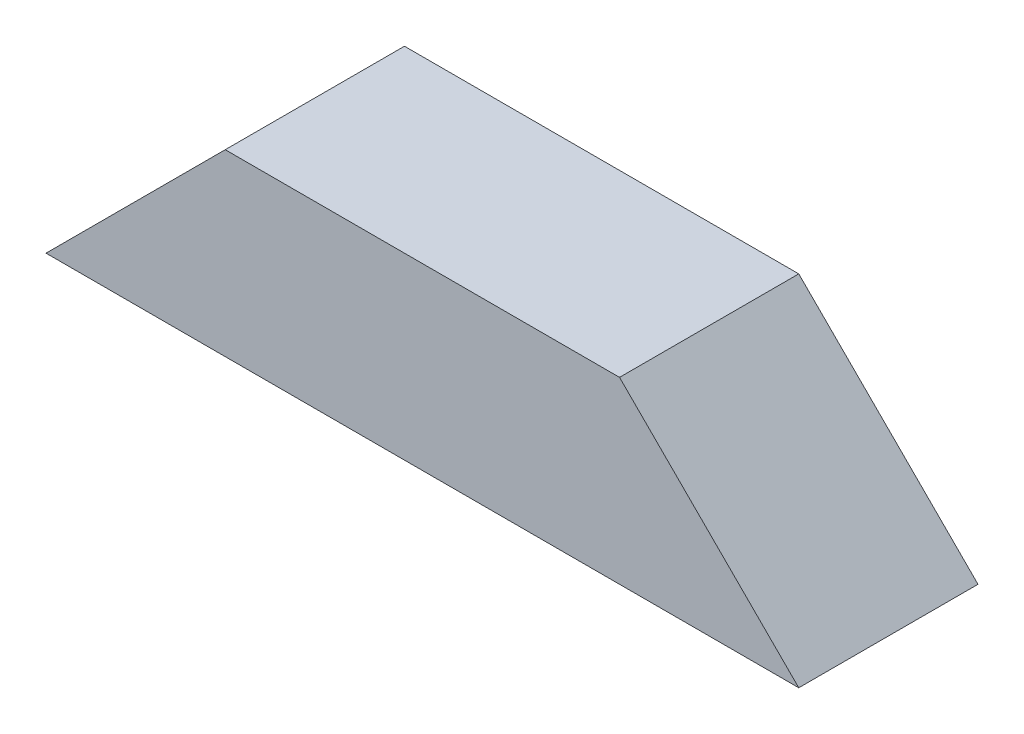
ISO-10303-21;
HEADER;
FILE_DESCRIPTION(('STEP AP214'),'2;1');
FILE_NAME('part.step','',(''),(''),'','','');
FILE_SCHEMA(('AUTOMOTIVE_DESIGN { 1 0 10303 214 1 1 1 1 }'));
ENDSEC;
DATA;
#1=APPLICATION_CONTEXT('core data for automotive mechanical design processes');
#2=APPLICATION_PROTOCOL_DEFINITION('international standard','automotive_design',2000,#1);
#3=PRODUCT_CONTEXT('',#1,'mechanical');
#4=PRODUCT('Part','Part','',(#3));
#5=PRODUCT_RELATED_PRODUCT_CATEGORY('part','',(#4));
#6=PRODUCT_DEFINITION_FORMATION('','',#4);
#7=PRODUCT_DEFINITION_CONTEXT('part definition',#1,'design');
#8=PRODUCT_DEFINITION('design','',#6,#7);
#9=PRODUCT_DEFINITION_SHAPE('','',#8);
#10=(LENGTH_UNIT() NAMED_UNIT(*) SI_UNIT(.MILLI.,.METRE.));
#11=(NAMED_UNIT(*) PLANE_ANGLE_UNIT() SI_UNIT($,.RADIAN.));
#12=(NAMED_UNIT(*) SI_UNIT($,.STERADIAN.) SOLID_ANGLE_UNIT());
#13=UNCERTAINTY_MEASURE_WITH_UNIT(LENGTH_MEASURE(1.E-05),#10,'distance_accuracy_value','');
#14=(GEOMETRIC_REPRESENTATION_CONTEXT(3) GLOBAL_UNCERTAINTY_ASSIGNED_CONTEXT((#13)) GLOBAL_UNIT_ASSIGNED_CONTEXT((#10,
#11,#12)) REPRESENTATION_CONTEXT('',''));
#15=CARTESIAN_POINT('',(0.,0.,0.));
#16=DIRECTION('',(0.,0.,1.));
#17=DIRECTION('',(1.,0.,0.));
#18=AXIS2_PLACEMENT_3D('',#15,#16,#17);
#19=CARTESIAN_POINT('',(77.2870340035174,99.844207637669,20.));
#20=DIRECTION('',(0.707106781186548,-0.707106781186548,0.));
#21=DIRECTION('',(0.707106781186548,0.707106781186548,0.));
#22=AXIS2_PLACEMENT_3D('',#19,#20,#21);
#23=PLANE('',#22);
#24=DIRECTION('',(-0.707106781186548,-0.707106781186548,0.));
#25=VECTOR('',#24,1.);
#26=CARTESIAN_POINT('',(77.2870340035174,99.844207637669,0.));
#27=LINE('',#26,#25);
#28=CARTESIAN_POINT('',(97.2870340035174,119.844207637669,0.));
#29=VERTEX_POINT('',#28);
#30=CARTESIAN_POINT('',(77.2870340035174,99.844207637669,0.));
#31=VERTEX_POINT('',#30);
#32=EDGE_CURVE('E109',#29,#31,#27,.T.);
#33=ORIENTED_EDGE('',*,*,#32,.T.);
#34=DIRECTION('',(0.,0.,-1.));
#35=VECTOR('',#34,1.);
#36=CARTESIAN_POINT('',(77.2870340035174,99.844207637669,20.));
#37=LINE('',#36,#35);
#38=CARTESIAN_POINT('',(77.2870340035174,99.844207637669,20.));
#39=VERTEX_POINT('',#38);
#40=EDGE_CURVE('E11',#39,#31,#37,.T.);
#41=ORIENTED_EDGE('',*,*,#40,.F.);
#42=DIRECTION('',(-0.707106781186548,-0.707106781186548,0.));
#43=VECTOR('',#42,1.);
#44=CARTESIAN_POINT('',(77.2870340035174,99.844207637669,20.));
#45=LINE('',#44,#43);
#46=CARTESIAN_POINT('',(97.2870340035174,119.844207637669,20.));
#47=VERTEX_POINT('',#46);
#48=EDGE_CURVE('E91',#47,#39,#45,.T.);
#49=ORIENTED_EDGE('',*,*,#48,.F.);
#50=DIRECTION('',(0.,0.,-1.));
#51=VECTOR('',#50,1.);
#52=CARTESIAN_POINT('',(97.2870340035174,119.844207637669,20.));
#53=LINE('',#52,#51);
#54=EDGE_CURVE('E105',#47,#29,#53,.T.);
#55=ORIENTED_EDGE('',*,*,#54,.T.);
#56=EDGE_LOOP('',(#33,#41,#49,#55));
#57=FACE_BOUND('',#56,.T.);
#58=ADVANCED_FACE('F39',(#57),#23,.F.);
#59=CARTESIAN_POINT('',(77.2870340035174,99.844207637669,20.));
#60=DIRECTION('',(0.,1.,0.));
#61=DIRECTION('',(-1.,0.,0.));
#62=AXIS2_PLACEMENT_3D('',#59,#60,#61);
#63=PLANE('',#62);
#64=DIRECTION('',(1.,0.,0.));
#65=VECTOR('',#64,1.);
#66=CARTESIAN_POINT('',(77.2870340035174,99.844207637669,0.));
#67=LINE('',#66,#65);
#68=CARTESIAN_POINT('',(161.287067603518,99.8442076376689,0.));
#69=VERTEX_POINT('',#68);
#70=EDGE_CURVE('E96',#31,#69,#67,.T.);
#71=ORIENTED_EDGE('',*,*,#70,.T.);
#72=DIRECTION('',(0.,0.,-1.));
#73=VECTOR('',#72,1.);
#74=CARTESIAN_POINT('',(161.287067603518,99.8442076376689,20.));
#75=LINE('',#74,#73);
#76=CARTESIAN_POINT('',(161.287067603518,99.8442076376689,20.));
#77=VERTEX_POINT('',#76);
#78=EDGE_CURVE('E48',#77,#69,#75,.T.);
#79=ORIENTED_EDGE('',*,*,#78,.F.);
#80=DIRECTION('',(1.,0.,0.));
#81=VECTOR('',#80,1.);
#82=CARTESIAN_POINT('',(77.2870340035174,99.844207637669,20.));
#83=LINE('',#82,#81);
#84=EDGE_CURVE('E86',#39,#77,#83,.T.);
#85=ORIENTED_EDGE('',*,*,#84,.F.);
#86=ORIENTED_EDGE('',*,*,#40,.T.);
#87=EDGE_LOOP('',(#71,#79,#85,#86));
#88=FACE_BOUND('',#87,.T.);
#89=ADVANCED_FACE('F95',(#88),#63,.F.);
#90=CARTESIAN_POINT('',(161.287067603518,99.8442076376689,20.));
#91=DIRECTION('',(-0.707106781186541,-0.707106781186554,0.));
#92=DIRECTION('',(0.707106781186554,-0.707106781186541,0.));
#93=AXIS2_PLACEMENT_3D('',#90,#91,#92);
#94=PLANE('',#93);
#95=DIRECTION('',(-0.707106781186554,0.707106781186541,0.));
#96=VECTOR('',#95,1.);
#97=CARTESIAN_POINT('',(161.287067603518,99.8442076376689,0.));
#98=LINE('',#97,#96);
#99=CARTESIAN_POINT('',(141.287067603517,119.844207637669,0.));
#100=VERTEX_POINT('',#99);
#101=EDGE_CURVE('E73',#69,#100,#98,.T.);
#102=ORIENTED_EDGE('',*,*,#101,.T.);
#103=DIRECTION('',(0.,0.,-1.));
#104=VECTOR('',#103,1.);
#105=CARTESIAN_POINT('',(141.287067603517,119.844207637669,20.));
#106=LINE('',#105,#104);
#107=CARTESIAN_POINT('',(141.287067603517,119.844207637669,20.));
#108=VERTEX_POINT('',#107);
#109=EDGE_CURVE('E98',#108,#100,#106,.T.);
#110=ORIENTED_EDGE('',*,*,#109,.F.);
#111=DIRECTION('',(-0.707106781186554,0.707106781186541,0.));
#112=VECTOR('',#111,1.);
#113=CARTESIAN_POINT('',(161.287067603518,99.8442076376689,20.));
#114=LINE('',#113,#112);
#115=EDGE_CURVE('E89',#77,#108,#114,.T.);
#116=ORIENTED_EDGE('',*,*,#115,.F.);
#117=ORIENTED_EDGE('',*,*,#78,.T.);
#118=EDGE_LOOP('',(#102,#110,#116,#117));
#119=FACE_BOUND('',#118,.T.);
#120=ADVANCED_FACE('F99',(#119),#94,.F.);
#121=CARTESIAN_POINT('',(97.2870340035174,119.844207637669,20.));
#122=DIRECTION('',(0.,-1.,0.));
#123=DIRECTION('',(0.,0.,-1.));
#124=AXIS2_PLACEMENT_3D('',#121,#122,#123);
#125=PLANE('',#124);
#126=DIRECTION('',(-1.,0.,0.));
#127=VECTOR('',#126,1.);
#128=CARTESIAN_POINT('',(97.2870340035174,119.844207637669,0.));
#129=LINE('',#128,#127);
#130=EDGE_CURVE('E79',#100,#29,#129,.T.);
#131=ORIENTED_EDGE('',*,*,#130,.T.);
#132=ORIENTED_EDGE('',*,*,#54,.F.);
#133=DIRECTION('',(-1.,0.,0.));
#134=VECTOR('',#133,1.);
#135=CARTESIAN_POINT('',(97.2870340035174,119.844207637669,20.));
#136=LINE('',#135,#134);
#137=EDGE_CURVE('E56',#108,#47,#136,.T.);
#138=ORIENTED_EDGE('',*,*,#137,.F.);
#139=ORIENTED_EDGE('',*,*,#109,.T.);
#140=EDGE_LOOP('',(#131,#132,#138,#139));
#141=FACE_BOUND('',#140,.T.);
#142=ADVANCED_FACE('F120',(#141),#125,.F.);
#143=CARTESIAN_POINT('',(0.,0.,20.));
#144=DIRECTION('',(0.,0.,1.));
#145=DIRECTION('',(1.,0.,0.));
#146=AXIS2_PLACEMENT_3D('',#143,#144,#145);
#147=PLANE('',#146);
#148=ORIENTED_EDGE('',*,*,#48,.T.);
#149=ORIENTED_EDGE('',*,*,#84,.T.);
#150=ORIENTED_EDGE('',*,*,#115,.T.);
#151=ORIENTED_EDGE('',*,*,#137,.T.);
#152=EDGE_LOOP('',(#148,#149,#150,#151));
#153=FACE_BOUND('',#152,.T.);
#154=ADVANCED_FACE('F87',(#153),#147,.T.);
#155=CARTESIAN_POINT('',(0.,0.,0.));
#156=DIRECTION('',(0.,0.,1.));
#157=DIRECTION('',(1.,0.,0.));
#158=AXIS2_PLACEMENT_3D('',#155,#156,#157);
#159=PLANE('',#158);
#160=ORIENTED_EDGE('',*,*,#32,.F.);
#161=ORIENTED_EDGE('',*,*,#130,.F.);
#162=ORIENTED_EDGE('',*,*,#101,.F.);
#163=ORIENTED_EDGE('',*,*,#70,.F.);
#164=EDGE_LOOP('',(#160,#161,#162,#163));
#165=FACE_BOUND('',#164,.T.);
#166=ADVANCED_FACE('F123',(#165),#159,.F.);
#167=CLOSED_SHELL('',(#58,#89,#120,#142,#154,#166));
#168=MANIFOLD_SOLID_BREP('B2',#167);
#169=ADVANCED_BREP_SHAPE_REPRESENTATION('',(#18,#168),#14);
#170=SHAPE_DEFINITION_REPRESENTATION(#9,#169);
ENDSEC;
END-ISO-10303-21;
